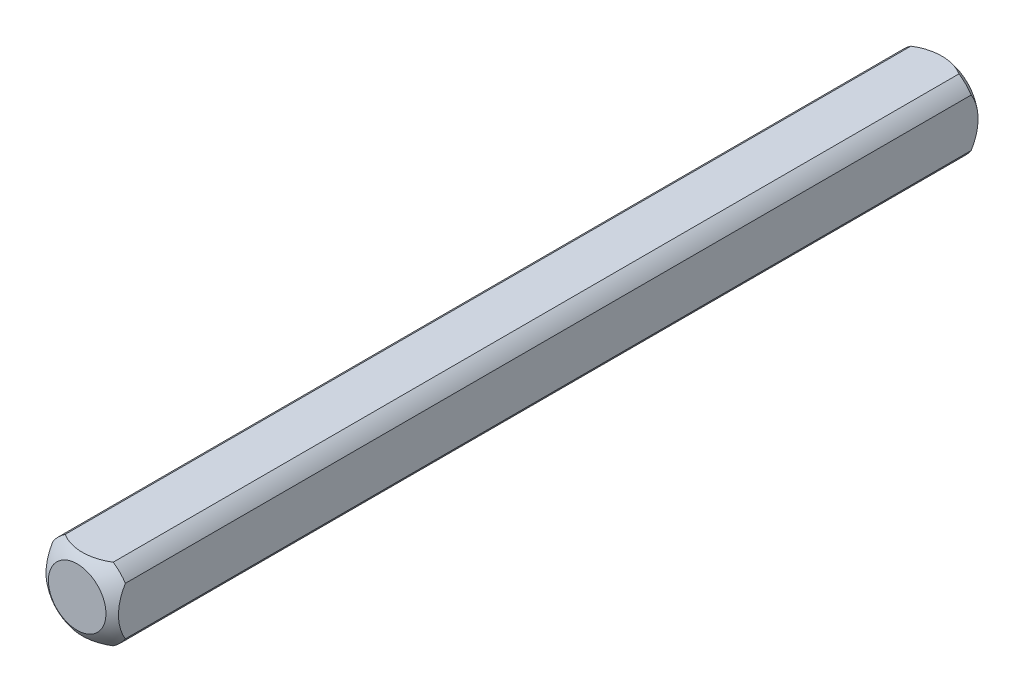
ISO-10303-21;
HEADER;
FILE_DESCRIPTION(('STEP AP214'),'2;1');
FILE_NAME('part.step','',(''),(''),'','','');
FILE_SCHEMA(('AUTOMOTIVE_DESIGN { 1 0 10303 214 1 1 1 1 }'));
ENDSEC;
DATA;
#1=APPLICATION_CONTEXT('core data for automotive mechanical design processes');
#2=APPLICATION_PROTOCOL_DEFINITION('international standard','automotive_design',2000,#1);
#3=PRODUCT_CONTEXT('',#1,'mechanical');
#4=PRODUCT('Part','Part','',(#3));
#5=PRODUCT_RELATED_PRODUCT_CATEGORY('part','',(#4));
#6=PRODUCT_DEFINITION_FORMATION('','',#4);
#7=PRODUCT_DEFINITION_CONTEXT('part definition',#1,'design');
#8=PRODUCT_DEFINITION('design','',#6,#7);
#9=PRODUCT_DEFINITION_SHAPE('','',#8);
#10=(LENGTH_UNIT() NAMED_UNIT(*) SI_UNIT(.MILLI.,.METRE.));
#11=(NAMED_UNIT(*) PLANE_ANGLE_UNIT() SI_UNIT($,.RADIAN.));
#12=(NAMED_UNIT(*) SI_UNIT($,.STERADIAN.) SOLID_ANGLE_UNIT());
#13=UNCERTAINTY_MEASURE_WITH_UNIT(LENGTH_MEASURE(1.E-05),#10,'distance_accuracy_value','');
#14=(GEOMETRIC_REPRESENTATION_CONTEXT(3) GLOBAL_UNCERTAINTY_ASSIGNED_CONTEXT((#13)) GLOBAL_UNIT_ASSIGNED_CONTEXT((#10,
#11,#12)) REPRESENTATION_CONTEXT('',''));
#15=CARTESIAN_POINT('',(0.,0.,0.));
#16=DIRECTION('',(0.,0.,1.));
#17=DIRECTION('',(1.,0.,0.));
#18=AXIS2_PLACEMENT_3D('',#15,#16,#17);
#19=CARTESIAN_POINT('',(-3.175,-3.175,38.1));
#20=DIRECTION('',(1.,0.,0.));
#21=DIRECTION('',(0.,0.,-1.));
#22=AXIS2_PLACEMENT_3D('',#19,#20,#21);
#23=PLANE('',#22);
#24=CARTESIAN_POINT('',(-3.175,0.,4.409725449428));
#25=DIRECTION('',(1.,0.,0.));
#26=DIRECTION('',(0.,0.,-1.));
#27=AXIS2_PLACEMENT_3D('',#24,#25,#26);
#28=CIRCLE('',#27,3.96557372898298);
#29=CARTESIAN_POINT('',(-3.175,-2.10605674187568,1.04962128437597));
#30=VERTEX_POINT('',#29);
#31=CARTESIAN_POINT('',(-3.175,2.10605674187568,1.049621284376));
#32=VERTEX_POINT('',#31);
#33=EDGE_CURVE('E47',#30,#32,#28,.T.);
#34=ORIENTED_EDGE('',*,*,#33,.F.);
#35=DIRECTION('',(0.,0.,-1.));
#36=VECTOR('',#35,1.);
#37=CARTESIAN_POINT('',(-3.175,-2.10605674187568,38.1));
#38=LINE('',#37,#36);
#39=CARTESIAN_POINT('',(-3.175,-2.10605674187568,75.150378715624));
#40=VERTEX_POINT('',#39);
#41=EDGE_CURVE('E40',#40,#30,#38,.T.);
#42=ORIENTED_EDGE('',*,*,#41,.F.);
#43=CARTESIAN_POINT('',(-3.175,0.,71.790274550572));
#44=DIRECTION('',(-1.,0.,0.));
#45=DIRECTION('',(0.,0.,1.));
#46=AXIS2_PLACEMENT_3D('',#43,#44,#45);
#47=CIRCLE('',#46,3.96557372898298);
#48=CARTESIAN_POINT('',(-3.175,2.10605674187568,75.150378715624));
#49=VERTEX_POINT('',#48);
#50=EDGE_CURVE('E123',#40,#49,#47,.T.);
#51=ORIENTED_EDGE('',*,*,#50,.T.);
#52=DIRECTION('',(0.,0.,-1.));
#53=VECTOR('',#52,1.);
#54=CARTESIAN_POINT('',(-3.175,2.10605674187568,38.1));
#55=LINE('',#54,#53);
#56=EDGE_CURVE('E111',#32,#49,#55,.F.);
#57=ORIENTED_EDGE('',*,*,#56,.F.);
#58=EDGE_LOOP('',(#34,#42,#51,#57));
#59=FACE_BOUND('',#58,.T.);
#60=ADVANCED_FACE('F33',(#59),#23,.F.);
#61=CARTESIAN_POINT('',(-3.175,-3.175,38.1));
#62=DIRECTION('',(0.,1.,0.));
#63=DIRECTION('',(0.,0.,1.));
#64=AXIS2_PLACEMENT_3D('',#61,#62,#63);
#65=PLANE('',#64);
#66=CARTESIAN_POINT('',(0.,-3.175,4.409725449428));
#67=DIRECTION('',(0.,1.,0.));
#68=DIRECTION('',(0.,0.,1.));
#69=AXIS2_PLACEMENT_3D('',#66,#67,#68);
#70=CIRCLE('',#69,3.96557372898298);
#71=CARTESIAN_POINT('',(2.10605674187568,-3.175,1.04962128437597));
#72=VERTEX_POINT('',#71);
#73=CARTESIAN_POINT('',(-2.10605674187568,-3.175,1.04962128437598));
#74=VERTEX_POINT('',#73);
#75=EDGE_CURVE('E152',#72,#74,#70,.T.);
#76=ORIENTED_EDGE('',*,*,#75,.F.);
#77=DIRECTION('',(0.,0.,-1.));
#78=VECTOR('',#77,1.);
#79=CARTESIAN_POINT('',(2.10605674187568,-3.175,38.1));
#80=LINE('',#79,#78);
#81=CARTESIAN_POINT('',(2.10605674187568,-3.175,75.150378715624));
#82=VERTEX_POINT('',#81);
#83=EDGE_CURVE('E165',#82,#72,#80,.T.);
#84=ORIENTED_EDGE('',*,*,#83,.F.);
#85=CARTESIAN_POINT('',(0.,-3.175,71.790274550572));
#86=DIRECTION('',(0.,-1.,0.));
#87=DIRECTION('',(0.,0.,-1.));
#88=AXIS2_PLACEMENT_3D('',#85,#86,#87);
#89=CIRCLE('',#88,3.96557372898298);
#90=CARTESIAN_POINT('',(-2.10605674187568,-3.175,75.150378715624));
#91=VERTEX_POINT('',#90);
#92=EDGE_CURVE('E134',#82,#91,#89,.T.);
#93=ORIENTED_EDGE('',*,*,#92,.T.);
#94=DIRECTION('',(0.,0.,-1.));
#95=VECTOR('',#94,1.);
#96=CARTESIAN_POINT('',(-2.10605674187568,-3.175,38.1));
#97=LINE('',#96,#95);
#98=EDGE_CURVE('E163',#74,#91,#97,.F.);
#99=ORIENTED_EDGE('',*,*,#98,.F.);
#100=EDGE_LOOP('',(#76,#84,#93,#99));
#101=FACE_BOUND('',#100,.T.);
#102=ADVANCED_FACE('F175',(#101),#65,.F.);
#103=CARTESIAN_POINT('',(3.175,-3.175,38.1));
#104=DIRECTION('',(-1.,0.,0.));
#105=DIRECTION('',(0.,0.,1.));
#106=AXIS2_PLACEMENT_3D('',#103,#104,#105);
#107=PLANE('',#106);
#108=CARTESIAN_POINT('',(3.175,0.,4.409725449428));
#109=DIRECTION('',(-1.,0.,0.));
#110=DIRECTION('',(0.,0.,1.));
#111=AXIS2_PLACEMENT_3D('',#108,#109,#110);
#112=CIRCLE('',#111,3.96557372898298);
#113=CARTESIAN_POINT('',(3.175,2.10605674187568,1.04962128437598));
#114=VERTEX_POINT('',#113);
#115=CARTESIAN_POINT('',(3.175,-2.10605674187568,1.04962128437597));
#116=VERTEX_POINT('',#115);
#117=EDGE_CURVE('E150',#114,#116,#112,.T.);
#118=ORIENTED_EDGE('',*,*,#117,.F.);
#119=DIRECTION('',(0.,0.,-1.));
#120=VECTOR('',#119,1.);
#121=CARTESIAN_POINT('',(3.175,2.10605674187568,38.1));
#122=LINE('',#121,#120);
#123=CARTESIAN_POINT('',(3.175,2.10605674187568,75.150378715624));
#124=VERTEX_POINT('',#123);
#125=EDGE_CURVE('E160',#124,#114,#122,.T.);
#126=ORIENTED_EDGE('',*,*,#125,.F.);
#127=CARTESIAN_POINT('',(3.175,0.,71.790274550572));
#128=DIRECTION('',(1.,0.,0.));
#129=DIRECTION('',(0.,0.,-1.));
#130=AXIS2_PLACEMENT_3D('',#127,#128,#129);
#131=CIRCLE('',#130,3.96557372898298);
#132=CARTESIAN_POINT('',(3.175,-2.10605674187568,75.150378715624));
#133=VERTEX_POINT('',#132);
#134=EDGE_CURVE('E131',#124,#133,#131,.T.);
#135=ORIENTED_EDGE('',*,*,#134,.T.);
#136=DIRECTION('',(0.,0.,-1.));
#137=VECTOR('',#136,1.);
#138=CARTESIAN_POINT('',(3.175,-2.10605674187568,38.1));
#139=LINE('',#138,#137);
#140=EDGE_CURVE('E104',#116,#133,#139,.F.);
#141=ORIENTED_EDGE('',*,*,#140,.F.);
#142=EDGE_LOOP('',(#118,#126,#135,#141));
#143=FACE_BOUND('',#142,.T.);
#144=ADVANCED_FACE('F182',(#143),#107,.F.);
#145=CARTESIAN_POINT('',(-3.175,3.175,38.1));
#146=DIRECTION('',(0.,-1.,0.));
#147=DIRECTION('',(0.,0.,-1.));
#148=AXIS2_PLACEMENT_3D('',#145,#146,#147);
#149=PLANE('',#148);
#150=CARTESIAN_POINT('',(0.,3.175,4.409725449428));
#151=DIRECTION('',(0.,-1.,0.));
#152=DIRECTION('',(0.,0.,-1.));
#153=AXIS2_PLACEMENT_3D('',#150,#151,#152);
#154=CIRCLE('',#153,3.96557372898299);
#155=CARTESIAN_POINT('',(-2.10605674187568,3.175,1.04962128437598));
#156=VERTEX_POINT('',#155);
#157=CARTESIAN_POINT('',(2.10605674187568,3.175,1.04962128437597));
#158=VERTEX_POINT('',#157);
#159=EDGE_CURVE('E102',#156,#158,#154,.T.);
#160=ORIENTED_EDGE('',*,*,#159,.F.);
#161=DIRECTION('',(0.,0.,-1.));
#162=VECTOR('',#161,1.);
#163=CARTESIAN_POINT('',(-2.10605674187568,3.175,38.1));
#164=LINE('',#163,#162);
#165=CARTESIAN_POINT('',(-2.10605674187568,3.175,75.150378715624));
#166=VERTEX_POINT('',#165);
#167=EDGE_CURVE('E96',#166,#156,#164,.T.);
#168=ORIENTED_EDGE('',*,*,#167,.F.);
#169=CARTESIAN_POINT('',(0.,3.175,71.790274550572));
#170=DIRECTION('',(0.,1.,0.));
#171=DIRECTION('',(0.,0.,1.));
#172=AXIS2_PLACEMENT_3D('',#169,#170,#171);
#173=CIRCLE('',#172,3.96557372898299);
#174=CARTESIAN_POINT('',(2.10605674187568,3.175,75.150378715624));
#175=VERTEX_POINT('',#174);
#176=EDGE_CURVE('E101',#166,#175,#173,.T.);
#177=ORIENTED_EDGE('',*,*,#176,.T.);
#178=DIRECTION('',(0.,0.,-1.));
#179=VECTOR('',#178,1.);
#180=CARTESIAN_POINT('',(2.10605674187568,3.175,38.1));
#181=LINE('',#180,#179);
#182=EDGE_CURVE('E105',#158,#175,#181,.F.);
#183=ORIENTED_EDGE('',*,*,#182,.F.);
#184=EDGE_LOOP('',(#160,#168,#177,#183));
#185=FACE_BOUND('',#184,.T.);
#186=ADVANCED_FACE('F98',(#185),#149,.F.);
#187=CARTESIAN_POINT('',(0.,0.,38.1));
#188=DIRECTION('',(0.,0.,-1.));
#189=DIRECTION('',(-1.,0.,0.));
#190=AXIS2_PLACEMENT_3D('',#187,#188,#189);
#191=CYLINDRICAL_SURFACE('',#190,3.81);
#192=ORIENTED_EDGE('',*,*,#41,.T.);
#193=CARTESIAN_POINT('',(0.,0.,1.04962128437598));
#194=DIRECTION('',(0.,0.,1.));
#195=DIRECTION('',(1.,0.,0.));
#196=AXIS2_PLACEMENT_3D('',#193,#194,#195);
#197=CIRCLE('',#196,3.81);
#198=EDGE_CURVE('E147',#30,#74,#197,.T.);
#199=ORIENTED_EDGE('',*,*,#198,.T.);
#200=ORIENTED_EDGE('',*,*,#98,.T.);
#201=CARTESIAN_POINT('',(0.,0.,75.150378715624));
#202=DIRECTION('',(0.,0.,1.));
#203=DIRECTION('',(1.,0.,0.));
#204=AXIS2_PLACEMENT_3D('',#201,#202,#203);
#205=CIRCLE('',#204,3.81);
#206=EDGE_CURVE('E128',#40,#91,#205,.T.);
#207=ORIENTED_EDGE('',*,*,#206,.F.);
#208=EDGE_LOOP('',(#192,#199,#200,#207));
#209=FACE_BOUND('',#208,.T.);
#210=ADVANCED_FACE('F171',(#209),#191,.T.);
#211=ORIENTED_EDGE('',*,*,#83,.T.);
#212=CARTESIAN_POINT('',(0.,0.,1.04962128437598));
#213=DIRECTION('',(0.,0.,1.));
#214=DIRECTION('',(1.,0.,0.));
#215=AXIS2_PLACEMENT_3D('',#212,#213,#214);
#216=CIRCLE('',#215,3.81);
#217=EDGE_CURVE('E53',#72,#116,#216,.T.);
#218=ORIENTED_EDGE('',*,*,#217,.T.);
#219=ORIENTED_EDGE('',*,*,#140,.T.);
#220=CARTESIAN_POINT('',(0.,0.,75.150378715624));
#221=DIRECTION('',(0.,0.,1.));
#222=DIRECTION('',(1.,0.,0.));
#223=AXIS2_PLACEMENT_3D('',#220,#221,#222);
#224=CIRCLE('',#223,3.81);
#225=EDGE_CURVE('E137',#82,#133,#224,.T.);
#226=ORIENTED_EDGE('',*,*,#225,.F.);
#227=EDGE_LOOP('',(#211,#218,#219,#226));
#228=FACE_BOUND('',#227,.T.);
#229=ADVANCED_FACE('F178',(#228),#191,.T.);
#230=ORIENTED_EDGE('',*,*,#125,.T.);
#231=CARTESIAN_POINT('',(0.,0.,1.04962128437598));
#232=DIRECTION('',(0.,0.,1.));
#233=DIRECTION('',(1.,0.,0.));
#234=AXIS2_PLACEMENT_3D('',#231,#232,#233);
#235=CIRCLE('',#234,3.81);
#236=EDGE_CURVE('E144',#114,#158,#235,.T.);
#237=ORIENTED_EDGE('',*,*,#236,.T.);
#238=ORIENTED_EDGE('',*,*,#182,.T.);
#239=CARTESIAN_POINT('',(0.,0.,75.150378715624));
#240=DIRECTION('',(0.,0.,1.));
#241=DIRECTION('',(1.,0.,0.));
#242=AXIS2_PLACEMENT_3D('',#239,#240,#241);
#243=CIRCLE('',#242,3.81);
#244=EDGE_CURVE('E122',#124,#175,#243,.T.);
#245=ORIENTED_EDGE('',*,*,#244,.F.);
#246=EDGE_LOOP('',(#230,#237,#238,#245));
#247=FACE_BOUND('',#246,.T.);
#248=ADVANCED_FACE('F184',(#247),#191,.T.);
#249=ORIENTED_EDGE('',*,*,#167,.T.);
#250=CARTESIAN_POINT('',(0.,0.,1.04962128437598));
#251=DIRECTION('',(0.,0.,1.));
#252=DIRECTION('',(1.,0.,0.));
#253=AXIS2_PLACEMENT_3D('',#250,#251,#252);
#254=CIRCLE('',#253,3.81);
#255=EDGE_CURVE('E12',#156,#32,#254,.T.);
#256=ORIENTED_EDGE('',*,*,#255,.T.);
#257=ORIENTED_EDGE('',*,*,#56,.T.);
#258=CARTESIAN_POINT('',(0.,0.,75.150378715624));
#259=DIRECTION('',(0.,0.,1.));
#260=DIRECTION('',(1.,0.,0.));
#261=AXIS2_PLACEMENT_3D('',#258,#259,#260);
#262=CIRCLE('',#261,3.81);
#263=EDGE_CURVE('E108',#166,#49,#262,.T.);
#264=ORIENTED_EDGE('',*,*,#263,.F.);
#265=EDGE_LOOP('',(#249,#256,#257,#264));
#266=FACE_BOUND('',#265,.T.);
#267=ADVANCED_FACE('F109',(#266),#191,.T.);
#268=CARTESIAN_POINT('',(0.,0.,4.409725449428));
#269=DIRECTION('',(0.,0.,1.));
#270=DIRECTION('',(-1.,0.,0.));
#271=AXIS2_PLACEMENT_3D('',#268,#269,#270);
#272=SPHERICAL_SURFACE('',#271,5.08);
#273=CARTESIAN_POINT('',(0.,0.,0.));
#274=DIRECTION('',(0.,0.,-1.));
#275=DIRECTION('',(-1.,0.,0.));
#276=AXIS2_PLACEMENT_3D('',#273,#274,#275);
#277=CIRCLE('',#276,2.52204707740896);
#278=CARTESIAN_POINT('',(-2.52204707740896,0.,0.));
#279=VERTEX_POINT('',#278);
#280=EDGE_CURVE('E155',#279,#279,#277,.T.);
#281=ORIENTED_EDGE('',*,*,#280,.F.);
#282=EDGE_LOOP('',(#281));
#283=FACE_BOUND('',#282,.T.);
#284=ORIENTED_EDGE('',*,*,#75,.T.);
#285=ORIENTED_EDGE('',*,*,#198,.F.);
#286=ORIENTED_EDGE('',*,*,#33,.T.);
#287=ORIENTED_EDGE('',*,*,#255,.F.);
#288=ORIENTED_EDGE('',*,*,#159,.T.);
#289=ORIENTED_EDGE('',*,*,#236,.F.);
#290=ORIENTED_EDGE('',*,*,#117,.T.);
#291=ORIENTED_EDGE('',*,*,#217,.F.);
#292=EDGE_LOOP('',(#284,#285,#286,#287,#288,#289,#290,#291));
#293=FACE_BOUND('',#292,.T.);
#294=ADVANCED_FACE('F185',(#283,#293),#272,.T.);
#295=CARTESIAN_POINT('',(0.,0.,0.));
#296=DIRECTION('',(0.,0.,-1.));
#297=DIRECTION('',(-1.,0.,0.));
#298=AXIS2_PLACEMENT_3D('',#295,#296,#297);
#299=PLANE('',#298);
#300=ORIENTED_EDGE('',*,*,#280,.T.);
#301=EDGE_LOOP('',(#300));
#302=FACE_BOUND('',#301,.T.);
#303=ADVANCED_FACE('F187',(#302),#299,.T.);
#304=CARTESIAN_POINT('',(0.,0.,71.790274550572));
#305=DIRECTION('',(0.,0.,-1.));
#306=DIRECTION('',(-1.,0.,0.));
#307=AXIS2_PLACEMENT_3D('',#304,#305,#306);
#308=SPHERICAL_SURFACE('',#307,5.08);
#309=CARTESIAN_POINT('',(0.,0.,76.2));
#310=DIRECTION('',(0.,0.,-1.));
#311=DIRECTION('',(-1.,0.,0.));
#312=AXIS2_PLACEMENT_3D('',#309,#310,#311);
#313=CIRCLE('',#312,2.52204707740896);
#314=CARTESIAN_POINT('',(-2.52204707740896,0.,76.2));
#315=VERTEX_POINT('',#314);
#316=EDGE_CURVE('E115',#315,#315,#313,.T.);
#317=ORIENTED_EDGE('',*,*,#316,.T.);
#318=EDGE_LOOP('',(#317));
#319=FACE_BOUND('',#318,.T.);
#320=ORIENTED_EDGE('',*,*,#92,.F.);
#321=ORIENTED_EDGE('',*,*,#225,.T.);
#322=ORIENTED_EDGE('',*,*,#134,.F.);
#323=ORIENTED_EDGE('',*,*,#244,.T.);
#324=ORIENTED_EDGE('',*,*,#176,.F.);
#325=ORIENTED_EDGE('',*,*,#263,.T.);
#326=ORIENTED_EDGE('',*,*,#50,.F.);
#327=ORIENTED_EDGE('',*,*,#206,.T.);
#328=EDGE_LOOP('',(#320,#321,#322,#323,#324,#325,#326,#327));
#329=FACE_BOUND('',#328,.T.);
#330=ADVANCED_FACE('F119',(#319,#329),#308,.T.);
#331=CARTESIAN_POINT('',(0.,0.,76.2));
#332=DIRECTION('',(0.,0.,1.));
#333=DIRECTION('',(-1.,0.,0.));
#334=AXIS2_PLACEMENT_3D('',#331,#332,#333);
#335=PLANE('',#334);
#336=ORIENTED_EDGE('',*,*,#316,.F.);
#337=EDGE_LOOP('',(#336));
#338=FACE_BOUND('',#337,.T.);
#339=ADVANCED_FACE('F232',(#338),#335,.T.);
#340=CLOSED_SHELL('',(#60,#102,#144,#186,#210,#229,#248,#267,#294,#303,#330,#339));
#341=MANIFOLD_SOLID_BREP('B2',#340);
#342=ADVANCED_BREP_SHAPE_REPRESENTATION('',(#18,#341),#14);
#343=SHAPE_DEFINITION_REPRESENTATION(#9,#342);
ENDSEC;
END-ISO-10303-21;
